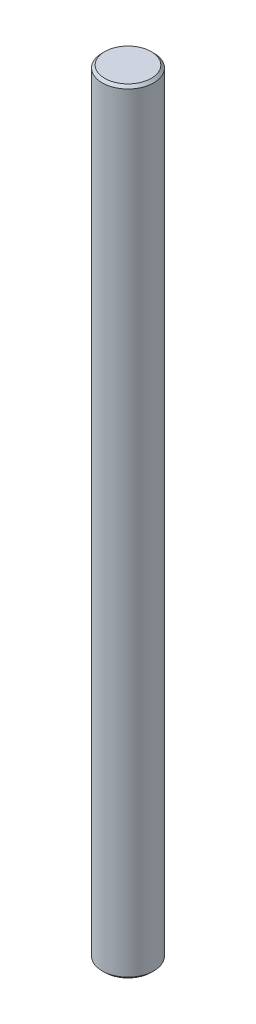
ISO-10303-21;
HEADER;
FILE_DESCRIPTION(('STEP AP214'),'2;1');
FILE_NAME('part.step','',(''),(''),'','','');
FILE_SCHEMA(('AUTOMOTIVE_DESIGN { 1 0 10303 214 1 1 1 1 }'));
ENDSEC;
DATA;
#1=APPLICATION_CONTEXT('core data for automotive mechanical design processes');
#2=APPLICATION_PROTOCOL_DEFINITION('international standard','automotive_design',2000,#1);
#3=PRODUCT_CONTEXT('',#1,'mechanical');
#4=PRODUCT('Part','Part','',(#3));
#5=PRODUCT_RELATED_PRODUCT_CATEGORY('part','',(#4));
#6=PRODUCT_DEFINITION_FORMATION('','',#4);
#7=PRODUCT_DEFINITION_CONTEXT('part definition',#1,'design');
#8=PRODUCT_DEFINITION('design','',#6,#7);
#9=PRODUCT_DEFINITION_SHAPE('','',#8);
#10=(LENGTH_UNIT() NAMED_UNIT(*) SI_UNIT(.MILLI.,.METRE.));
#11=(NAMED_UNIT(*) PLANE_ANGLE_UNIT() SI_UNIT($,.RADIAN.));
#12=(NAMED_UNIT(*) SI_UNIT($,.STERADIAN.) SOLID_ANGLE_UNIT());
#13=UNCERTAINTY_MEASURE_WITH_UNIT(LENGTH_MEASURE(1.E-05),#10,'distance_accuracy_value','');
#14=(GEOMETRIC_REPRESENTATION_CONTEXT(3) GLOBAL_UNCERTAINTY_ASSIGNED_CONTEXT((#13)) GLOBAL_UNIT_ASSIGNED_CONTEXT((#10,
#11,#12)) REPRESENTATION_CONTEXT('',''));
#15=CARTESIAN_POINT('',(0.,0.,0.));
#16=DIRECTION('',(0.,0.,1.));
#17=DIRECTION('',(1.,0.,0.));
#18=AXIS2_PLACEMENT_3D('',#15,#16,#17);
#19=CARTESIAN_POINT('',(0.,300.,0.));
#20=DIRECTION('',(0.,-1.,0.));
#21=DIRECTION('',(0.,0.,-1.));
#22=AXIS2_PLACEMENT_3D('',#19,#20,#21);
#23=CYLINDRICAL_SURFACE('',#22,10.);
#24=CARTESIAN_POINT('',(0.,299.,0.));
#25=DIRECTION('',(0.,1.,0.));
#26=DIRECTION('',(0.,0.,1.));
#27=AXIS2_PLACEMENT_3D('',#24,#25,#26);
#28=CIRCLE('',#27,10.);
#29=CARTESIAN_POINT('',(0.,299.,10.));
#30=VERTEX_POINT('',#29);
#31=EDGE_CURVE('E45',#30,#30,#28,.F.);
#32=ORIENTED_EDGE('',*,*,#31,.T.);
#33=EDGE_LOOP('',(#32));
#34=FACE_BOUND('',#33,.T.);
#35=CARTESIAN_POINT('',(0.,1.,0.));
#36=DIRECTION('',(0.,1.,0.));
#37=DIRECTION('',(0.,0.,1.));
#38=AXIS2_PLACEMENT_3D('',#35,#36,#37);
#39=CIRCLE('',#38,10.);
#40=CARTESIAN_POINT('',(0.,1.,10.));
#41=VERTEX_POINT('',#40);
#42=EDGE_CURVE('E50',#41,#41,#39,.T.);
#43=ORIENTED_EDGE('',*,*,#42,.T.);
#44=EDGE_LOOP('',(#43));
#45=FACE_BOUND('',#44,.T.);
#46=ADVANCED_FACE('F37',(#34,#45),#23,.T.);
#47=CARTESIAN_POINT('',(0.,300.,0.));
#48=DIRECTION('',(0.,1.,0.));
#49=DIRECTION('',(0.,0.,1.));
#50=AXIS2_PLACEMENT_3D('',#47,#48,#49);
#51=PLANE('',#50);
#52=CARTESIAN_POINT('',(0.,300.,0.));
#53=DIRECTION('',(0.,1.,0.));
#54=DIRECTION('',(0.,0.,1.));
#55=AXIS2_PLACEMENT_3D('',#52,#53,#54);
#56=CIRCLE('',#55,9.00000000000004);
#57=CARTESIAN_POINT('',(0.,300.,9.00000000000004));
#58=VERTEX_POINT('',#57);
#59=EDGE_CURVE('E55',#58,#58,#56,.T.);
#60=ORIENTED_EDGE('',*,*,#59,.T.);
#61=EDGE_LOOP('',(#60));
#62=FACE_BOUND('',#61,.T.);
#63=ADVANCED_FACE('F62',(#62),#51,.T.);
#64=CARTESIAN_POINT('',(0.,0.,0.));
#65=DIRECTION('',(0.,1.,0.));
#66=DIRECTION('',(0.,0.,1.));
#67=AXIS2_PLACEMENT_3D('',#64,#65,#66);
#68=PLANE('',#67);
#69=CARTESIAN_POINT('',(0.,0.,0.));
#70=DIRECTION('',(0.,1.,0.));
#71=DIRECTION('',(0.,0.,1.));
#72=AXIS2_PLACEMENT_3D('',#69,#70,#71);
#73=CIRCLE('',#72,8.99999999999998);
#74=CARTESIAN_POINT('',(0.,0.,8.99999999999998));
#75=VERTEX_POINT('',#74);
#76=EDGE_CURVE('E10',#75,#75,#73,.F.);
#77=ORIENTED_EDGE('',*,*,#76,.T.);
#78=EDGE_LOOP('',(#77));
#79=FACE_BOUND('',#78,.T.);
#80=ADVANCED_FACE('F66',(#79),#68,.F.);
#81=CARTESIAN_POINT('',(0.,300.,0.));
#82=DIRECTION('',(0.,-1.,0.));
#83=DIRECTION('',(0.,0.,-1.));
#84=AXIS2_PLACEMENT_3D('',#81,#82,#83);
#85=CONICAL_SURFACE('',#84,9.00000000000004,0.785398163397457);
#86=ORIENTED_EDGE('',*,*,#31,.F.);
#87=EDGE_LOOP('',(#86));
#88=FACE_BOUND('',#87,.T.);
#89=ORIENTED_EDGE('',*,*,#59,.F.);
#90=EDGE_LOOP('',(#89));
#91=FACE_BOUND('',#90,.T.);
#92=ADVANCED_FACE('F64',(#88,#91),#85,.T.);
#93=CARTESIAN_POINT('',(0.,1.,0.));
#94=DIRECTION('',(0.,1.,0.));
#95=DIRECTION('',(0.,0.,1.));
#96=AXIS2_PLACEMENT_3D('',#93,#94,#95);
#97=CONICAL_SURFACE('',#96,10.,0.785398163397457);
#98=ORIENTED_EDGE('',*,*,#76,.F.);
#99=EDGE_LOOP('',(#98));
#100=FACE_BOUND('',#99,.T.);
#101=ORIENTED_EDGE('',*,*,#42,.F.);
#102=EDGE_LOOP('',(#101));
#103=FACE_BOUND('',#102,.T.);
#104=ADVANCED_FACE('F39',(#100,#103),#97,.T.);
#105=CLOSED_SHELL('',(#46,#63,#80,#92,#104));
#106=MANIFOLD_SOLID_BREP('B2',#105);
#107=ADVANCED_BREP_SHAPE_REPRESENTATION('',(#18,#106),#14);
#108=SHAPE_DEFINITION_REPRESENTATION(#9,#107);
ENDSEC;
END-ISO-10303-21;
